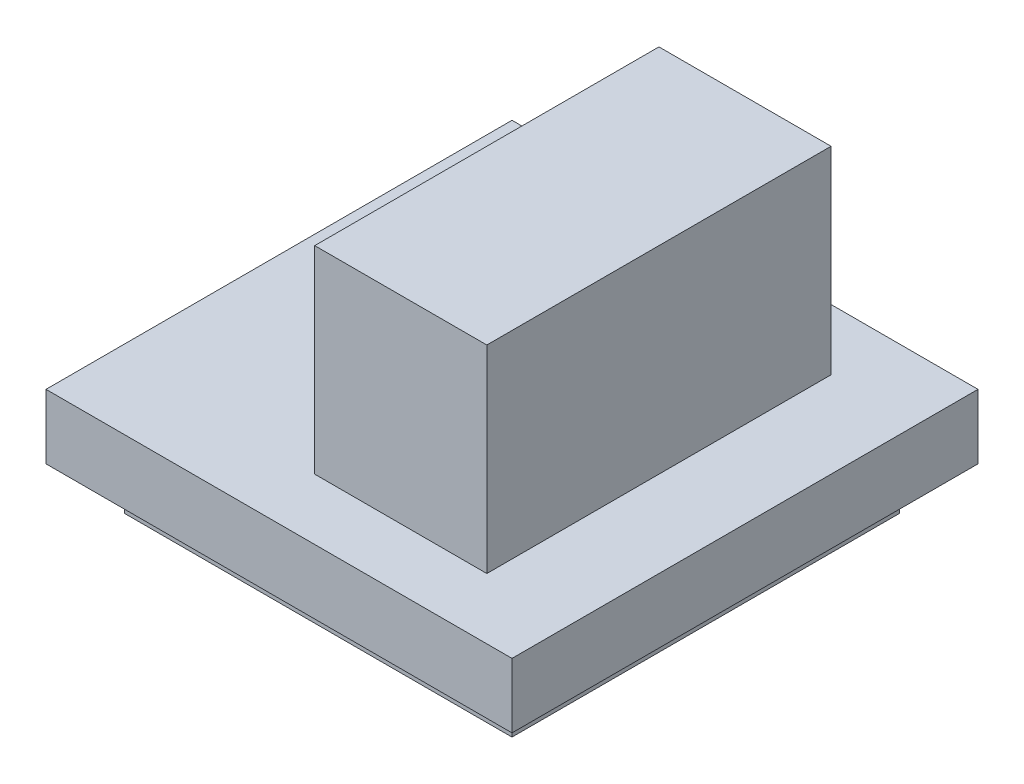
ISO-10303-21;
HEADER;
FILE_DESCRIPTION(('STEP AP214'),'2;1');
FILE_NAME('part.step','',(''),(''),'','','');
FILE_SCHEMA(('AUTOMOTIVE_DESIGN { 1 0 10303 214 1 1 1 1 }'));
ENDSEC;
DATA;
#1=APPLICATION_CONTEXT('core data for automotive mechanical design processes');
#2=APPLICATION_PROTOCOL_DEFINITION('international standard','automotive_design',2000,#1);
#3=PRODUCT_CONTEXT('',#1,'mechanical');
#4=PRODUCT('Part','Part','',(#3));
#5=PRODUCT_RELATED_PRODUCT_CATEGORY('part','',(#4));
#6=PRODUCT_DEFINITION_FORMATION('','',#4);
#7=PRODUCT_DEFINITION_CONTEXT('part definition',#1,'design');
#8=PRODUCT_DEFINITION('design','',#6,#7);
#9=PRODUCT_DEFINITION_SHAPE('','',#8);
#10=(LENGTH_UNIT() NAMED_UNIT(*) SI_UNIT(.MILLI.,.METRE.));
#11=(NAMED_UNIT(*) PLANE_ANGLE_UNIT() SI_UNIT($,.RADIAN.));
#12=(NAMED_UNIT(*) SI_UNIT($,.STERADIAN.) SOLID_ANGLE_UNIT());
#13=UNCERTAINTY_MEASURE_WITH_UNIT(LENGTH_MEASURE(1.E-05),#10,'distance_accuracy_value','');
#14=(GEOMETRIC_REPRESENTATION_CONTEXT(3) GLOBAL_UNCERTAINTY_ASSIGNED_CONTEXT((#13)) GLOBAL_UNIT_ASSIGNED_CONTEXT((#10,
#11,#12)) REPRESENTATION_CONTEXT('',''));
#15=CARTESIAN_POINT('',(0.,0.,0.));
#16=DIRECTION('',(0.,0.,1.));
#17=DIRECTION('',(1.,0.,0.));
#18=AXIS2_PLACEMENT_3D('',#15,#16,#17);
#19=CARTESIAN_POINT('',(5.41499999999998,1.5,-5.41499999999994));
#20=DIRECTION('',(0.,-1.,0.));
#21=DIRECTION('',(0.,0.,-1.));
#22=AXIS2_PLACEMENT_3D('',#19,#20,#21);
#23=PLANE('',#22);
#24=DIRECTION('',(0.,0.,-1.));
#25=VECTOR('',#24,1.);
#26=CARTESIAN_POINT('',(5.41499999999997,1.50000000000004,5.41500000000005));
#27=LINE('',#26,#25);
#28=CARTESIAN_POINT('',(5.41499999999997,1.50000000000004,5.41500000000005));
#29=VERTEX_POINT('',#28);
#30=CARTESIAN_POINT('',(5.41499999999998,1.5,-5.41499999999994));
#31=VERTEX_POINT('',#30);
#32=EDGE_CURVE('E230',#29,#31,#27,.T.);
#33=ORIENTED_EDGE('',*,*,#32,.T.);
#34=DIRECTION('',(-1.,0.,0.));
#35=VECTOR('',#34,1.);
#36=CARTESIAN_POINT('',(-5.41500000000001,1.49999999999997,-5.41499999999997));
#37=LINE('',#36,#35);
#38=CARTESIAN_POINT('',(-5.41500000000001,1.49999999999997,-5.41499999999997));
#39=VERTEX_POINT('',#38);
#40=EDGE_CURVE('E234',#31,#39,#37,.T.);
#41=ORIENTED_EDGE('',*,*,#40,.T.);
#42=DIRECTION('',(0.,0.,1.));
#43=VECTOR('',#42,1.);
#44=CARTESIAN_POINT('',(-5.415,1.49999999999996,5.41500000000003));
#45=LINE('',#44,#43);
#46=CARTESIAN_POINT('',(-5.415,1.49999999999996,5.41500000000003));
#47=VERTEX_POINT('',#46);
#48=EDGE_CURVE('E237',#39,#47,#45,.T.);
#49=ORIENTED_EDGE('',*,*,#48,.T.);
#50=DIRECTION('',(1.,0.,0.));
#51=VECTOR('',#50,1.);
#52=CARTESIAN_POINT('',(-5.415,1.49999999999996,5.41500000000003));
#53=LINE('',#52,#51);
#54=EDGE_CURVE('E240',#47,#29,#53,.T.);
#55=ORIENTED_EDGE('',*,*,#54,.T.);
#56=EDGE_LOOP('',(#33,#41,#49,#55));
#57=FACE_BOUND('',#56,.T.);
#58=DIRECTION('',(0.,0.,-1.));
#59=VECTOR('',#58,1.);
#60=CARTESIAN_POINT('',(3.41499999999999,1.50000000000002,4.00000000000005));
#61=LINE('',#60,#59);
#62=CARTESIAN_POINT('',(3.41499999999999,1.50000000000002,4.00000000000005));
#63=VERTEX_POINT('',#62);
#64=CARTESIAN_POINT('',(3.41499999999999,1.49999999999996,-3.99999999999997));
#65=VERTEX_POINT('',#64);
#66=EDGE_CURVE('E178',#63,#65,#61,.T.);
#67=ORIENTED_EDGE('',*,*,#66,.F.);
#68=DIRECTION('',(1.,0.,0.));
#69=VECTOR('',#68,1.);
#70=CARTESIAN_POINT('',(-0.584999999999981,1.49999999999995,4.00000000000004));
#71=LINE('',#70,#69);
#72=CARTESIAN_POINT('',(-0.584999999999981,1.49999999999992,4.00000000000005));
#73=VERTEX_POINT('',#72);
#74=EDGE_CURVE('E175',#73,#63,#71,.T.);
#75=ORIENTED_EDGE('',*,*,#74,.F.);
#76=DIRECTION('',(0.,0.,1.));
#77=VECTOR('',#76,1.);
#78=CARTESIAN_POINT('',(-0.584999999999981,1.49999999999995,4.00000000000004));
#79=LINE('',#78,#77);
#80=CARTESIAN_POINT('',(-0.584999999999995,1.49999999999999,-3.99999999999999));
#81=VERTEX_POINT('',#80);
#82=EDGE_CURVE('E69',#81,#73,#79,.T.);
#83=ORIENTED_EDGE('',*,*,#82,.F.);
#84=DIRECTION('',(-1.,0.,0.));
#85=VECTOR('',#84,1.);
#86=CARTESIAN_POINT('',(-0.584999999999995,1.49999999999999,-3.99999999999999));
#87=LINE('',#86,#85);
#88=EDGE_CURVE('E61',#65,#81,#87,.T.);
#89=ORIENTED_EDGE('',*,*,#88,.F.);
#90=EDGE_LOOP('',(#67,#75,#83,#89));
#91=FACE_BOUND('',#90,.T.);
#92=ADVANCED_FACE('F42',(#57,#91),#23,.F.);
#93=CARTESIAN_POINT('',(5.41500000000003,0.,-5.41499999999993));
#94=DIRECTION('',(0.,-1.,0.));
#95=DIRECTION('',(0.,0.,-1.));
#96=AXIS2_PLACEMENT_3D('',#93,#94,#95);
#97=PLANE('',#96);
#98=DIRECTION('',(0.,0.,-1.));
#99=VECTOR('',#98,1.);
#100=CARTESIAN_POINT('',(5.415,0.,5.41500000000004));
#101=LINE('',#100,#99);
#102=CARTESIAN_POINT('',(5.415,0.,5.41500000000004));
#103=VERTEX_POINT('',#102);
#104=CARTESIAN_POINT('',(5.41500000000003,0.,-5.41499999999993));
#105=VERTEX_POINT('',#104);
#106=EDGE_CURVE('E229',#103,#105,#101,.T.);
#107=ORIENTED_EDGE('',*,*,#106,.F.);
#108=DIRECTION('',(1.,0.,0.));
#109=VECTOR('',#108,1.);
#110=CARTESIAN_POINT('',(-5.41500000000001,0.,5.41500000000004));
#111=LINE('',#110,#109);
#112=CARTESIAN_POINT('',(-5.41500000000001,0.,5.41500000000004));
#113=VERTEX_POINT('',#112);
#114=EDGE_CURVE('E235',#113,#103,#111,.T.);
#115=ORIENTED_EDGE('',*,*,#114,.F.);
#116=DIRECTION('',(0.,0.,1.));
#117=VECTOR('',#116,1.);
#118=CARTESIAN_POINT('',(-5.41500000000001,0.,5.41500000000004));
#119=LINE('',#118,#117);
#120=CARTESIAN_POINT('',(-5.41499999999999,0.,-5.41499999999996));
#121=VERTEX_POINT('',#120);
#122=EDGE_CURVE('E250',#121,#113,#119,.T.);
#123=ORIENTED_EDGE('',*,*,#122,.F.);
#124=DIRECTION('',(-1.,0.,0.));
#125=VECTOR('',#124,1.);
#126=CARTESIAN_POINT('',(-5.41499999999999,0.,-5.41499999999996));
#127=LINE('',#126,#125);
#128=EDGE_CURVE('E247',#105,#121,#127,.T.);
#129=ORIENTED_EDGE('',*,*,#128,.F.);
#130=EDGE_LOOP('',(#107,#115,#123,#129));
#131=FACE_BOUND('',#130,.T.);
#132=DIRECTION('',(1.,0.,0.));
#133=VECTOR('',#132,1.);
#134=CARTESIAN_POINT('',(4.49999999999997,0.,-4.49999999999996));
#135=LINE('',#134,#133);
#136=CARTESIAN_POINT('',(-4.49999999999999,0.,-4.49999999999996));
#137=VERTEX_POINT('',#136);
#138=CARTESIAN_POINT('',(4.49999999999997,0.,-4.49999999999996));
#139=VERTEX_POINT('',#138);
#140=EDGE_CURVE('E186',#137,#139,#135,.T.);
#141=ORIENTED_EDGE('',*,*,#140,.F.);
#142=DIRECTION('',(0.,0.,-1.));
#143=VECTOR('',#142,1.);
#144=CARTESIAN_POINT('',(-4.49999999999999,0.,4.50000000000006));
#145=LINE('',#144,#143);
#146=CARTESIAN_POINT('',(-4.49999999999999,0.,4.50000000000006));
#147=VERTEX_POINT('',#146);
#148=EDGE_CURVE('E180',#147,#137,#145,.T.);
#149=ORIENTED_EDGE('',*,*,#148,.F.);
#150=DIRECTION('',(-1.,0.,0.));
#151=VECTOR('',#150,1.);
#152=CARTESIAN_POINT('',(4.50000000000001,0.,4.50000000000004));
#153=LINE('',#152,#151);
#154=CARTESIAN_POINT('',(4.50000000000001,0.,4.50000000000004));
#155=VERTEX_POINT('',#154);
#156=EDGE_CURVE('E198',#155,#147,#153,.T.);
#157=ORIENTED_EDGE('',*,*,#156,.F.);
#158=DIRECTION('',(0.,0.,1.));
#159=VECTOR('',#158,1.);
#160=CARTESIAN_POINT('',(4.50000000000001,0.,4.50000000000004));
#161=LINE('',#160,#159);
#162=EDGE_CURVE('E210',#139,#155,#161,.T.);
#163=ORIENTED_EDGE('',*,*,#162,.F.);
#164=EDGE_LOOP('',(#141,#149,#157,#163));
#165=FACE_BOUND('',#164,.T.);
#166=ADVANCED_FACE('F273',(#131,#165),#97,.T.);
#167=CARTESIAN_POINT('',(5.41499999999997,1.50000000000004,5.41500000000005));
#168=DIRECTION('',(-1.,0.,0.));
#169=DIRECTION('',(0.,0.,1.));
#170=AXIS2_PLACEMENT_3D('',#167,#168,#169);
#171=PLANE('',#170);
#172=ORIENTED_EDGE('',*,*,#106,.T.);
#173=DIRECTION('',(0.,-1.,0.));
#174=VECTOR('',#173,1.);
#175=CARTESIAN_POINT('',(5.41499999999998,1.5,-5.41499999999994));
#176=LINE('',#175,#174);
#177=EDGE_CURVE('E11',#31,#105,#176,.T.);
#178=ORIENTED_EDGE('',*,*,#177,.F.);
#179=ORIENTED_EDGE('',*,*,#32,.F.);
#180=DIRECTION('',(0.,-1.,0.));
#181=VECTOR('',#180,1.);
#182=CARTESIAN_POINT('',(5.41499999999997,1.50000000000004,5.41500000000005));
#183=LINE('',#182,#181);
#184=EDGE_CURVE('E243',#29,#103,#183,.T.);
#185=ORIENTED_EDGE('',*,*,#184,.T.);
#186=EDGE_LOOP('',(#172,#178,#179,#185));
#187=FACE_BOUND('',#186,.T.);
#188=ADVANCED_FACE('F44',(#187),#171,.F.);
#189=CARTESIAN_POINT('',(-5.41500000000001,1.49999999999997,-5.41499999999997));
#190=DIRECTION('',(0.,0.,1.));
#191=DIRECTION('',(1.,0.,0.));
#192=AXIS2_PLACEMENT_3D('',#189,#190,#191);
#193=PLANE('',#192);
#194=ORIENTED_EDGE('',*,*,#128,.T.);
#195=DIRECTION('',(0.,-1.,0.));
#196=VECTOR('',#195,1.);
#197=CARTESIAN_POINT('',(-5.41500000000001,1.49999999999997,-5.41499999999997));
#198=LINE('',#197,#196);
#199=EDGE_CURVE('E51',#39,#121,#198,.T.);
#200=ORIENTED_EDGE('',*,*,#199,.F.);
#201=ORIENTED_EDGE('',*,*,#40,.F.);
#202=ORIENTED_EDGE('',*,*,#177,.T.);
#203=EDGE_LOOP('',(#194,#200,#201,#202));
#204=FACE_BOUND('',#203,.T.);
#205=ADVANCED_FACE('F283',(#204),#193,.F.);
#206=CARTESIAN_POINT('',(-5.415,1.49999999999996,5.41500000000003));
#207=DIRECTION('',(1.,0.,0.));
#208=DIRECTION('',(0.,0.,-1.));
#209=AXIS2_PLACEMENT_3D('',#206,#207,#208);
#210=PLANE('',#209);
#211=ORIENTED_EDGE('',*,*,#122,.T.);
#212=DIRECTION('',(0.,-1.,0.));
#213=VECTOR('',#212,1.);
#214=CARTESIAN_POINT('',(-5.415,1.49999999999996,5.41500000000003));
#215=LINE('',#214,#213);
#216=EDGE_CURVE('E258',#47,#113,#215,.T.);
#217=ORIENTED_EDGE('',*,*,#216,.F.);
#218=ORIENTED_EDGE('',*,*,#48,.F.);
#219=ORIENTED_EDGE('',*,*,#199,.T.);
#220=EDGE_LOOP('',(#211,#217,#218,#219));
#221=FACE_BOUND('',#220,.T.);
#222=ADVANCED_FACE('F267',(#221),#210,.F.);
#223=CARTESIAN_POINT('',(-5.415,1.49999999999996,5.41500000000003));
#224=DIRECTION('',(0.,0.,-1.));
#225=DIRECTION('',(-1.,0.,0.));
#226=AXIS2_PLACEMENT_3D('',#223,#224,#225);
#227=PLANE('',#226);
#228=ORIENTED_EDGE('',*,*,#114,.T.);
#229=ORIENTED_EDGE('',*,*,#184,.F.);
#230=ORIENTED_EDGE('',*,*,#54,.F.);
#231=ORIENTED_EDGE('',*,*,#216,.T.);
#232=EDGE_LOOP('',(#228,#229,#230,#231));
#233=FACE_BOUND('',#232,.T.);
#234=ADVANCED_FACE('F277',(#233),#227,.F.);
#235=CARTESIAN_POINT('',(-4.49999999999998,-1.00000000000006,4.50000000000003));
#236=DIRECTION('',(1.,0.,0.));
#237=DIRECTION('',(0.,0.,-1.));
#238=AXIS2_PLACEMENT_3D('',#235,#236,#237);
#239=PLANE('',#238);
#240=ORIENTED_EDGE('',*,*,#148,.T.);
#241=DIRECTION('',(0.,1.,0.));
#242=VECTOR('',#241,1.);
#243=CARTESIAN_POINT('',(-4.5,-1.,-4.49999999999994));
#244=LINE('',#243,#242);
#245=CARTESIAN_POINT('',(-4.5,-1.,-4.49999999999994));
#246=VERTEX_POINT('',#245);
#247=EDGE_CURVE('E226',#246,#137,#244,.T.);
#248=ORIENTED_EDGE('',*,*,#247,.F.);
#249=DIRECTION('',(0.,0.,-1.));
#250=VECTOR('',#249,1.);
#251=CARTESIAN_POINT('',(-4.49999999999998,-1.00000000000006,4.50000000000003));
#252=LINE('',#251,#250);
#253=CARTESIAN_POINT('',(-4.49999999999998,-1.00000000000006,4.50000000000003));
#254=VERTEX_POINT('',#253);
#255=EDGE_CURVE('E193',#254,#246,#252,.T.);
#256=ORIENTED_EDGE('',*,*,#255,.F.);
#257=DIRECTION('',(0.,1.,0.));
#258=VECTOR('',#257,1.);
#259=CARTESIAN_POINT('',(-4.49999999999998,-1.00000000000006,4.50000000000003));
#260=LINE('',#259,#258);
#261=EDGE_CURVE('E206',#254,#147,#260,.T.);
#262=ORIENTED_EDGE('',*,*,#261,.T.);
#263=EDGE_LOOP('',(#240,#248,#256,#262));
#264=FACE_BOUND('',#263,.T.);
#265=ADVANCED_FACE('F297',(#264),#239,.F.);
#266=CARTESIAN_POINT('',(4.50000000000004,-1.00000000000008,-4.49999999999996));
#267=DIRECTION('',(0.,0.,1.));
#268=DIRECTION('',(1.,0.,0.));
#269=AXIS2_PLACEMENT_3D('',#266,#267,#268);
#270=PLANE('',#269);
#271=ORIENTED_EDGE('',*,*,#140,.T.);
#272=DIRECTION('',(0.,1.,0.));
#273=VECTOR('',#272,1.);
#274=CARTESIAN_POINT('',(4.50000000000004,-1.00000000000008,-4.49999999999996));
#275=LINE('',#274,#273);
#276=CARTESIAN_POINT('',(4.50000000000004,-1.00000000000008,-4.49999999999996));
#277=VERTEX_POINT('',#276);
#278=EDGE_CURVE('E222',#277,#139,#275,.T.);
#279=ORIENTED_EDGE('',*,*,#278,.F.);
#280=DIRECTION('',(1.,0.,0.));
#281=VECTOR('',#280,1.);
#282=CARTESIAN_POINT('',(4.50000000000004,-1.00000000000008,-4.49999999999996));
#283=LINE('',#282,#281);
#284=EDGE_CURVE('E197',#246,#277,#283,.T.);
#285=ORIENTED_EDGE('',*,*,#284,.F.);
#286=ORIENTED_EDGE('',*,*,#247,.T.);
#287=EDGE_LOOP('',(#271,#279,#285,#286));
#288=FACE_BOUND('',#287,.T.);
#289=ADVANCED_FACE('F304',(#288),#270,.F.);
#290=CARTESIAN_POINT('',(4.5,-1.00000000000006,4.50000000000003));
#291=DIRECTION('',(-1.,0.,0.));
#292=DIRECTION('',(0.,0.,1.));
#293=AXIS2_PLACEMENT_3D('',#290,#291,#292);
#294=PLANE('',#293);
#295=ORIENTED_EDGE('',*,*,#162,.T.);
#296=DIRECTION('',(0.,1.,0.));
#297=VECTOR('',#296,1.);
#298=CARTESIAN_POINT('',(4.5,-1.00000000000006,4.50000000000003));
#299=LINE('',#298,#297);
#300=CARTESIAN_POINT('',(4.5,-1.00000000000006,4.50000000000003));
#301=VERTEX_POINT('',#300);
#302=EDGE_CURVE('E219',#301,#155,#299,.T.);
#303=ORIENTED_EDGE('',*,*,#302,.F.);
#304=DIRECTION('',(0.,0.,1.));
#305=VECTOR('',#304,1.);
#306=CARTESIAN_POINT('',(4.5,-1.00000000000006,4.50000000000003));
#307=LINE('',#306,#305);
#308=EDGE_CURVE('E201',#277,#301,#307,.T.);
#309=ORIENTED_EDGE('',*,*,#308,.F.);
#310=ORIENTED_EDGE('',*,*,#278,.T.);
#311=EDGE_LOOP('',(#295,#303,#309,#310));
#312=FACE_BOUND('',#311,.T.);
#313=ADVANCED_FACE('F309',(#312),#294,.F.);
#314=CARTESIAN_POINT('',(4.5,-1.00000000000006,4.50000000000003));
#315=DIRECTION('',(0.,0.,-1.));
#316=DIRECTION('',(-1.,0.,0.));
#317=AXIS2_PLACEMENT_3D('',#314,#315,#316);
#318=PLANE('',#317);
#319=ORIENTED_EDGE('',*,*,#156,.T.);
#320=ORIENTED_EDGE('',*,*,#261,.F.);
#321=DIRECTION('',(-1.,0.,0.));
#322=VECTOR('',#321,1.);
#323=CARTESIAN_POINT('',(4.5,-1.00000000000006,4.50000000000003));
#324=LINE('',#323,#322);
#325=EDGE_CURVE('E204',#301,#254,#324,.T.);
#326=ORIENTED_EDGE('',*,*,#325,.F.);
#327=ORIENTED_EDGE('',*,*,#302,.T.);
#328=EDGE_LOOP('',(#319,#320,#326,#327));
#329=FACE_BOUND('',#328,.T.);
#330=ADVANCED_FACE('F326',(#329),#318,.F.);
#331=CARTESIAN_POINT('',(-4.5,-1.,-4.49999999999994));
#332=DIRECTION('',(0.,1.,0.));
#333=DIRECTION('',(0.,0.,1.));
#334=AXIS2_PLACEMENT_3D('',#331,#332,#333);
#335=PLANE('',#334);
#336=ORIENTED_EDGE('',*,*,#255,.T.);
#337=ORIENTED_EDGE('',*,*,#284,.T.);
#338=ORIENTED_EDGE('',*,*,#308,.T.);
#339=ORIENTED_EDGE('',*,*,#325,.T.);
#340=EDGE_LOOP('',(#336,#337,#338,#339));
#341=FACE_BOUND('',#340,.T.);
#342=ADVANCED_FACE('F324',(#341),#335,.F.);
#343=CARTESIAN_POINT('',(3.41499999999999,6.09999999999993,4.00000000000005));
#344=DIRECTION('',(-1.,0.,0.));
#345=DIRECTION('',(0.,0.,1.));
#346=AXIS2_PLACEMENT_3D('',#343,#344,#345);
#347=PLANE('',#346);
#348=ORIENTED_EDGE('',*,*,#66,.T.);
#349=DIRECTION('',(0.,-1.,0.));
#350=VECTOR('',#349,1.);
#351=CARTESIAN_POINT('',(3.41499999999999,6.1,-3.99999999999998));
#352=LINE('',#351,#350);
#353=CARTESIAN_POINT('',(3.41499999999999,6.1,-3.99999999999998));
#354=VERTEX_POINT('',#353);
#355=EDGE_CURVE('E157',#354,#65,#352,.T.);
#356=ORIENTED_EDGE('',*,*,#355,.F.);
#357=DIRECTION('',(0.,0.,-1.));
#358=VECTOR('',#357,1.);
#359=CARTESIAN_POINT('',(3.41499999999999,6.09999999999993,4.00000000000005));
#360=LINE('',#359,#358);
#361=CARTESIAN_POINT('',(3.41499999999999,6.09999999999993,4.00000000000005));
#362=VERTEX_POINT('',#361);
#363=EDGE_CURVE('E165',#362,#354,#360,.T.);
#364=ORIENTED_EDGE('',*,*,#363,.F.);
#365=DIRECTION('',(0.,-1.,0.));
#366=VECTOR('',#365,1.);
#367=CARTESIAN_POINT('',(3.41499999999999,6.09999999999993,4.00000000000005));
#368=LINE('',#367,#366);
#369=EDGE_CURVE('E439',#362,#63,#368,.T.);
#370=ORIENTED_EDGE('',*,*,#369,.T.);
#371=EDGE_LOOP('',(#348,#356,#364,#370));
#372=FACE_BOUND('',#371,.T.);
#373=ADVANCED_FACE('F177',(#372),#347,.F.);
#374=CARTESIAN_POINT('',(-0.585000000000016,6.09999999999996,-3.99999999999997));
#375=DIRECTION('',(0.,0.,1.));
#376=DIRECTION('',(1.,0.,0.));
#377=AXIS2_PLACEMENT_3D('',#374,#375,#376);
#378=PLANE('',#377);
#379=ORIENTED_EDGE('',*,*,#88,.T.);
#380=DIRECTION('',(0.,-1.,0.));
#381=VECTOR('',#380,1.);
#382=CARTESIAN_POINT('',(-0.585000000000016,6.09999999999996,-3.99999999999997));
#383=LINE('',#382,#381);
#384=CARTESIAN_POINT('',(-0.585000000000016,6.09999999999996,-3.99999999999997));
#385=VERTEX_POINT('',#384);
#386=EDGE_CURVE('E160',#385,#81,#383,.T.);
#387=ORIENTED_EDGE('',*,*,#386,.F.);
#388=DIRECTION('',(-1.,0.,0.));
#389=VECTOR('',#388,1.);
#390=CARTESIAN_POINT('',(-0.585000000000016,6.09999999999996,-3.99999999999997));
#391=LINE('',#390,#389);
#392=EDGE_CURVE('E153',#354,#385,#391,.T.);
#393=ORIENTED_EDGE('',*,*,#392,.F.);
#394=ORIENTED_EDGE('',*,*,#355,.T.);
#395=EDGE_LOOP('',(#379,#387,#393,#394));
#396=FACE_BOUND('',#395,.T.);
#397=ADVANCED_FACE('F155',(#396),#378,.F.);
#398=CARTESIAN_POINT('',(-0.584999999999995,6.09999999999995,4.00000000000004));
#399=DIRECTION('',(1.,0.,0.));
#400=DIRECTION('',(0.,0.,-1.));
#401=AXIS2_PLACEMENT_3D('',#398,#399,#400);
#402=PLANE('',#401);
#403=ORIENTED_EDGE('',*,*,#82,.T.);
#404=DIRECTION('',(0.,-1.,0.));
#405=VECTOR('',#404,1.);
#406=CARTESIAN_POINT('',(-0.584999999999995,6.09999999999995,4.00000000000004));
#407=LINE('',#406,#405);
#408=CARTESIAN_POINT('',(-0.584999999999995,6.09999999999995,4.00000000000004));
#409=VERTEX_POINT('',#408);
#410=EDGE_CURVE('E189',#409,#73,#407,.T.);
#411=ORIENTED_EDGE('',*,*,#410,.F.);
#412=DIRECTION('',(0.,0.,1.));
#413=VECTOR('',#412,1.);
#414=CARTESIAN_POINT('',(-0.584999999999995,6.09999999999995,4.00000000000004));
#415=LINE('',#414,#413);
#416=EDGE_CURVE('E164',#385,#409,#415,.T.);
#417=ORIENTED_EDGE('',*,*,#416,.F.);
#418=ORIENTED_EDGE('',*,*,#386,.T.);
#419=EDGE_LOOP('',(#403,#411,#417,#418));
#420=FACE_BOUND('',#419,.T.);
#421=ADVANCED_FACE('F340',(#420),#402,.F.);
#422=CARTESIAN_POINT('',(-0.584999999999995,6.09999999999995,4.00000000000004));
#423=DIRECTION('',(0.,0.,-1.));
#424=DIRECTION('',(-1.,0.,0.));
#425=AXIS2_PLACEMENT_3D('',#422,#423,#424);
#426=PLANE('',#425);
#427=ORIENTED_EDGE('',*,*,#74,.T.);
#428=ORIENTED_EDGE('',*,*,#369,.F.);
#429=DIRECTION('',(1.,0.,0.));
#430=VECTOR('',#429,1.);
#431=CARTESIAN_POINT('',(-0.584999999999995,6.09999999999995,4.00000000000004));
#432=LINE('',#431,#430);
#433=EDGE_CURVE('E170',#409,#362,#432,.T.);
#434=ORIENTED_EDGE('',*,*,#433,.F.);
#435=ORIENTED_EDGE('',*,*,#410,.T.);
#436=EDGE_LOOP('',(#427,#428,#434,#435));
#437=FACE_BOUND('',#436,.T.);
#438=ADVANCED_FACE('F343',(#437),#426,.F.);
#439=CARTESIAN_POINT('',(3.41499999999999,6.1,-3.99999999999998));
#440=DIRECTION('',(0.,-1.,0.));
#441=DIRECTION('',(0.,0.,-1.));
#442=AXIS2_PLACEMENT_3D('',#439,#440,#441);
#443=PLANE('',#442);
#444=ORIENTED_EDGE('',*,*,#363,.T.);
#445=ORIENTED_EDGE('',*,*,#392,.T.);
#446=ORIENTED_EDGE('',*,*,#416,.T.);
#447=ORIENTED_EDGE('',*,*,#433,.T.);
#448=EDGE_LOOP('',(#444,#445,#446,#447));
#449=FACE_BOUND('',#448,.T.);
#450=ADVANCED_FACE('F168',(#449),#443,.F.);
#451=CLOSED_SHELL('',(#92,#166,#188,#205,#222,#234,#265,#289,#313,#330,#342,#373,#397,#421,#438,#450));
#452=MANIFOLD_SOLID_BREP('B2',#451);
#453=ADVANCED_BREP_SHAPE_REPRESENTATION('',(#18,#452),#14);
#454=SHAPE_DEFINITION_REPRESENTATION(#9,#453);
ENDSEC;
END-ISO-10303-21;
